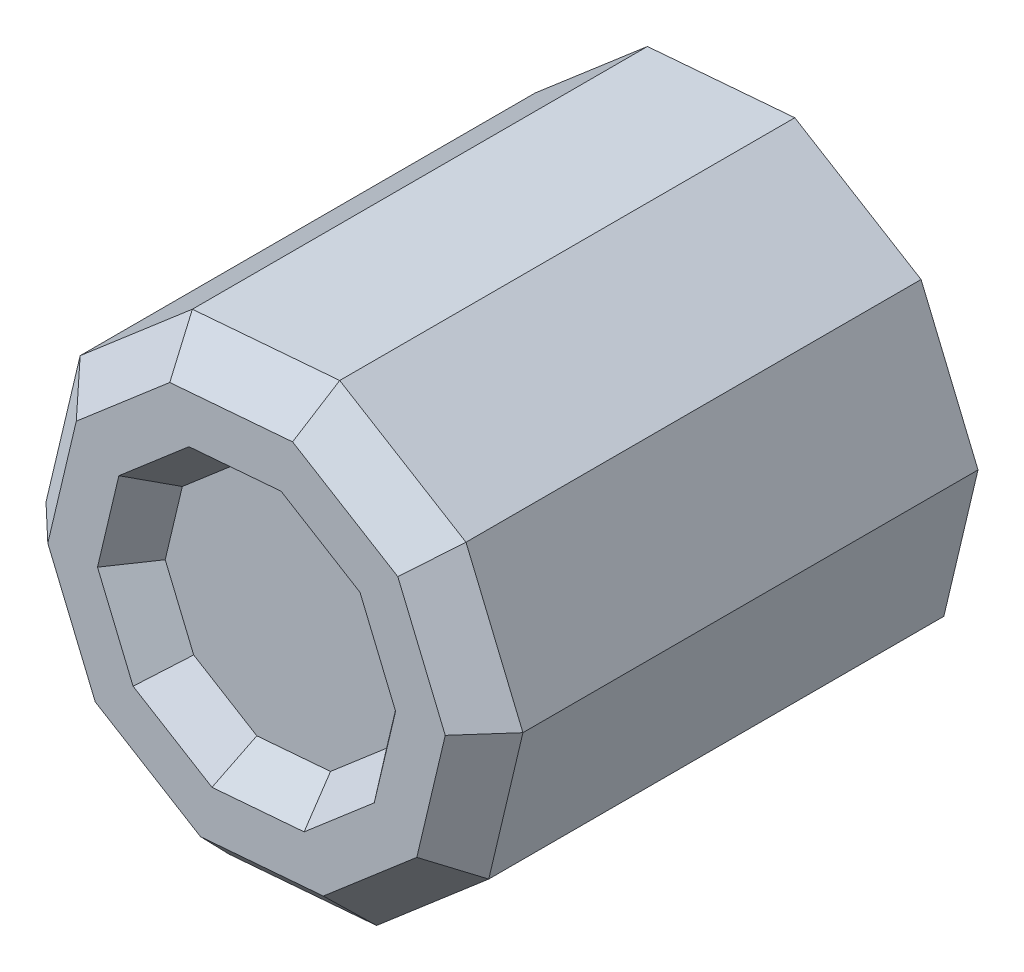
ISO-10303-21;
HEADER;
FILE_DESCRIPTION(('STEP AP214'),'2;1');
FILE_NAME('part.step','',(''),(''),'','','');
FILE_SCHEMA(('AUTOMOTIVE_DESIGN { 1 0 10303 214 1 1 1 1 }'));
ENDSEC;
DATA;
#1=APPLICATION_CONTEXT('core data for automotive mechanical design processes');
#2=APPLICATION_PROTOCOL_DEFINITION('international standard','automotive_design',2000,#1);
#3=PRODUCT_CONTEXT('',#1,'mechanical');
#4=PRODUCT('Part','Part','',(#3));
#5=PRODUCT_RELATED_PRODUCT_CATEGORY('part','',(#4));
#6=PRODUCT_DEFINITION_FORMATION('','',#4);
#7=PRODUCT_DEFINITION_CONTEXT('part definition',#1,'design');
#8=PRODUCT_DEFINITION('design','',#6,#7);
#9=PRODUCT_DEFINITION_SHAPE('','',#8);
#10=(LENGTH_UNIT() NAMED_UNIT(*) SI_UNIT(.MILLI.,.METRE.));
#11=(NAMED_UNIT(*) PLANE_ANGLE_UNIT() SI_UNIT($,.RADIAN.));
#12=(NAMED_UNIT(*) SI_UNIT($,.STERADIAN.) SOLID_ANGLE_UNIT());
#13=UNCERTAINTY_MEASURE_WITH_UNIT(LENGTH_MEASURE(1.E-05),#10,'distance_accuracy_value','');
#14=(GEOMETRIC_REPRESENTATION_CONTEXT(3) GLOBAL_UNCERTAINTY_ASSIGNED_CONTEXT((#13)) GLOBAL_UNIT_ASSIGNED_CONTEXT((#10,
#11,#12)) REPRESENTATION_CONTEXT('',''));
#15=CARTESIAN_POINT('',(0.,0.,0.));
#16=DIRECTION('',(0.,0.,1.));
#17=DIRECTION('',(1.,0.,0.));
#18=AXIS2_PLACEMENT_3D('',#15,#16,#17);
#19=CARTESIAN_POINT('',(0.,0.,12.));
#20=DIRECTION('',(0.,0.,1.));
#21=DIRECTION('',(1.,0.,0.));
#22=AXIS2_PLACEMENT_3D('',#19,#20,#21);
#23=PLANE('',#22);
#24=DIRECTION('',(-0.996714502075238,-0.0809950699296505,0.));
#25=VECTOR('',#24,1.);
#26=CARTESIAN_POINT('',(0.910714137433383,3.83636773347429,12.));
#27=LINE('',#26,#25);
#28=CARTESIAN_POINT('',(0.910714137433383,3.83636773347429,12.));
#29=VERTEX_POINT('',#28);
#30=CARTESIAN_POINT('',(-1.51817716190576,3.63899103209,12.));
#31=VERTEX_POINT('',#30);
#32=EDGE_CURVE('E569',#29,#31,#27,.T.);
#33=ORIENTED_EDGE('',*,*,#32,.F.);
#34=DIRECTION('',(-0.853966678331878,0.520327697032187,0.));
#35=VECTOR('',#34,1.);
#36=CARTESIAN_POINT('',(2.99174359030801,2.56838235401479,12.));
#37=LINE('',#36,#35);
#38=CARTESIAN_POINT('',(2.99174359030801,2.56838235401479,12.));
#39=VERTEX_POINT('',#38);
#40=EDGE_CURVE('E300',#39,#29,#37,.T.);
#41=ORIENTED_EDGE('',*,*,#40,.F.);
#42=DIRECTION('',(-0.385032608725588,0.922902969015686,0.));
#43=VECTOR('',#42,1.);
#44=CARTESIAN_POINT('',(3.93002867730962,0.319362211427114,12.));
#45=LINE('',#44,#43);
#46=CARTESIAN_POINT('',(3.93002867730962,0.319362211427114,12.));
#47=VERTEX_POINT('',#46);
#48=EDGE_CURVE('E304',#47,#39,#45,.T.);
#49=ORIENTED_EDGE('',*,*,#48,.F.);
#50=DIRECTION('',(0.230970830636836,0.972960675153385,0.));
#51=VECTOR('',#50,1.);
#52=CARTESIAN_POINT('',(3.36717638634075,-2.05164344120339,12.));
#53=LINE('',#52,#51);
#54=CARTESIAN_POINT('',(3.36717638634075,-2.05164344120339,12.));
#55=VERTEX_POINT('',#54);
#56=EDGE_CURVE('E564',#55,#47,#53,.T.);
#57=ORIENTED_EDGE('',*,*,#56,.F.);
#58=DIRECTION('',(0.758751263105786,0.651380473099535,0.));
#59=VECTOR('',#58,1.);
#60=CARTESIAN_POINT('',(1.51817716190576,-3.63899103209,12.));
#61=LINE('',#60,#59);
#62=CARTESIAN_POINT('',(1.51817716190576,-3.63899103209,12.));
#63=VERTEX_POINT('',#62);
#64=EDGE_CURVE('E577',#63,#55,#61,.T.);
#65=ORIENTED_EDGE('',*,*,#64,.F.);
#66=DIRECTION('',(0.996714502075238,0.0809950699296506,0.));
#67=VECTOR('',#66,1.);
#68=CARTESIAN_POINT('',(-0.910714137433379,-3.83636773347429,12.));
#69=LINE('',#68,#67);
#70=CARTESIAN_POINT('',(-0.910714137433379,-3.83636773347429,12.));
#71=VERTEX_POINT('',#70);
#72=EDGE_CURVE('E400',#71,#63,#69,.T.);
#73=ORIENTED_EDGE('',*,*,#72,.F.);
#74=DIRECTION('',(0.853966678331878,-0.520327697032187,0.));
#75=VECTOR('',#74,1.);
#76=CARTESIAN_POINT('',(-2.99174359030801,-2.56838235401479,12.));
#77=LINE('',#76,#75);
#78=CARTESIAN_POINT('',(-2.99174359030801,-2.56838235401479,12.));
#79=VERTEX_POINT('',#78);
#80=EDGE_CURVE('E420',#79,#71,#77,.T.);
#81=ORIENTED_EDGE('',*,*,#80,.F.);
#82=DIRECTION('',(0.385032608725588,-0.922902969015686,0.));
#83=VECTOR('',#82,1.);
#84=CARTESIAN_POINT('',(-3.93002867730962,-0.319362211427115,12.));
#85=LINE('',#84,#83);
#86=CARTESIAN_POINT('',(-3.93002867730962,-0.319362211427115,12.));
#87=VERTEX_POINT('',#86);
#88=EDGE_CURVE('E584',#87,#79,#85,.T.);
#89=ORIENTED_EDGE('',*,*,#88,.F.);
#90=DIRECTION('',(-0.230970830636837,-0.972960675153384,0.));
#91=VECTOR('',#90,1.);
#92=CARTESIAN_POINT('',(-3.36717638634075,2.05164344120339,12.));
#93=LINE('',#92,#91);
#94=CARTESIAN_POINT('',(-3.36717638634075,2.05164344120339,12.));
#95=VERTEX_POINT('',#94);
#96=EDGE_CURVE('E593',#95,#87,#93,.T.);
#97=ORIENTED_EDGE('',*,*,#96,.F.);
#98=DIRECTION('',(-0.758751263105786,-0.651380473099535,0.));
#99=VECTOR('',#98,1.);
#100=CARTESIAN_POINT('',(-1.51817716190576,3.63899103209,12.));
#101=LINE('',#100,#99);
#102=EDGE_CURVE('E84',#31,#95,#101,.T.);
#103=ORIENTED_EDGE('',*,*,#102,.F.);
#104=EDGE_LOOP('',(#33,#41,#49,#57,#65,#73,#81,#89,#97,#103));
#105=FACE_BOUND('',#104,.T.);
#106=DIRECTION('',(0.230970830636847,0.972960675153382,0.));
#107=VECTOR('',#106,1.);
#108=CARTESIAN_POINT('',(5.31508520854203,0.741950368920169,12.));
#109=LINE('',#108,#107);
#110=CARTESIAN_POINT('',(4.48956851512098,-2.73552458827124,12.));
#111=VERTEX_POINT('',#110);
#112=CARTESIAN_POINT('',(5.24003823641284,0.425816281902766,12.));
#113=VERTEX_POINT('',#112);
#114=EDGE_CURVE('E827',#111,#113,#109,.T.);
#115=ORIENTED_EDGE('',*,*,#114,.T.);
#116=DIRECTION('',(-0.385032608725579,0.92290296901569,0.));
#117=VECTOR('',#116,1.);
#118=CARTESIAN_POINT('',(3.86388677547718,3.72437915769805,12.));
#119=LINE('',#118,#117);
#120=CARTESIAN_POINT('',(3.98899145374405,3.42450980535302,12.));
#121=VERTEX_POINT('',#120);
#122=EDGE_CURVE('E830',#113,#121,#119,.T.);
#123=ORIENTED_EDGE('',*,*,#122,.T.);
#124=DIRECTION('',(-0.853966678331873,0.520327697032195,0.));
#125=VECTOR('',#124,1.);
#126=CARTESIAN_POINT('',(0.936814922861278,5.28422169522697,12.));
#127=LINE('',#126,#125);
#128=CARTESIAN_POINT('',(1.21428551657789,5.11515697796571,12.));
#129=VERTEX_POINT('',#128);
#130=EDGE_CURVE('E803',#121,#129,#127,.T.);
#131=ORIENTED_EDGE('',*,*,#130,.T.);
#132=DIRECTION('',(-0.99671450207524,-0.0809950699296405,0.));
#133=VECTOR('',#132,1.);
#134=CARTESIAN_POINT('',(-2.34808838911952,4.82567114926879,12.));
#135=LINE('',#134,#133);
#136=CARTESIAN_POINT('',(-2.0242362158743,4.85198804278669,12.));
#137=VERTEX_POINT('',#136);
#138=EDGE_CURVE('E806',#129,#137,#135,.T.);
#139=ORIENTED_EDGE('',*,*,#138,.T.);
#140=DIRECTION('',(-0.758751263105793,-0.651380473099528,0.));
#141=VECTOR('',#140,1.);
#142=CARTESIAN_POINT('',(-4.73610174504565,2.52387824281969,12.));
#143=LINE('',#142,#141);
#144=CARTESIAN_POINT('',(-4.48956851512098,2.73552458827124,12.));
#145=VERTEX_POINT('',#144);
#146=EDGE_CURVE('E809',#137,#145,#143,.T.);
#147=ORIENTED_EDGE('',*,*,#146,.T.);
#148=DIRECTION('',(-0.230970830636847,-0.972960675153382,0.));
#149=VECTOR('',#148,1.);
#150=CARTESIAN_POINT('',(-5.31508520854203,-0.741950368920166,12.));
#151=LINE('',#150,#149);
#152=CARTESIAN_POINT('',(-5.24003823641284,-0.425816281902766,12.));
#153=VERTEX_POINT('',#152);
#154=EDGE_CURVE('E812',#145,#153,#151,.T.);
#155=ORIENTED_EDGE('',*,*,#154,.T.);
#156=DIRECTION('',(0.385032608725579,-0.92290296901569,0.));
#157=VECTOR('',#156,1.);
#158=CARTESIAN_POINT('',(-3.86388677547717,-3.72437915769805,12.));
#159=LINE('',#158,#157);
#160=CARTESIAN_POINT('',(-3.98899145374405,-3.42450980535302,12.));
#161=VERTEX_POINT('',#160);
#162=EDGE_CURVE('E815',#153,#161,#159,.T.);
#163=ORIENTED_EDGE('',*,*,#162,.T.);
#164=DIRECTION('',(0.853966678331873,-0.520327697032195,0.));
#165=VECTOR('',#164,1.);
#166=CARTESIAN_POINT('',(-0.936814922861274,-5.28422169522697,12.));
#167=LINE('',#166,#165);
#168=CARTESIAN_POINT('',(-1.21428551657789,-5.11515697796571,12.));
#169=VERTEX_POINT('',#168);
#170=EDGE_CURVE('E818',#161,#169,#167,.T.);
#171=ORIENTED_EDGE('',*,*,#170,.T.);
#172=DIRECTION('',(0.99671450207524,0.0809950699296404,0.));
#173=VECTOR('',#172,1.);
#174=CARTESIAN_POINT('',(2.34808838911952,-4.82567114926879,12.));
#175=LINE('',#174,#173);
#176=CARTESIAN_POINT('',(2.0242362158743,-4.85198804278669,12.));
#177=VERTEX_POINT('',#176);
#178=EDGE_CURVE('E821',#169,#177,#175,.T.);
#179=ORIENTED_EDGE('',*,*,#178,.T.);
#180=DIRECTION('',(0.758751263105793,0.651380473099527,0.));
#181=VECTOR('',#180,1.);
#182=CARTESIAN_POINT('',(4.73610174504565,-2.52387824281969,12.));
#183=LINE('',#182,#181);
#184=EDGE_CURVE('E824',#177,#111,#183,.T.);
#185=ORIENTED_EDGE('',*,*,#184,.T.);
#186=EDGE_LOOP('',(#115,#123,#131,#139,#147,#155,#163,#171,#179,#185));
#187=FACE_BOUND('',#186,.T.);
#188=ADVANCED_FACE('F67',(#105,#187),#23,.T.);
#189=CARTESIAN_POINT('',(4.78678974449287,4.10941176642363,12.));
#190=DIRECTION('',(-0.520327697032195,-0.853966678331873,0.));
#191=DIRECTION('',(0.853966678331873,-0.520327697032195,0.));
#192=AXIS2_PLACEMENT_3D('',#189,#190,#191);
#193=PLANE('',#192);
#194=DIRECTION('',(0.,0.,-1.));
#195=VECTOR('',#194,1.);
#196=CARTESIAN_POINT('',(1.45714261989347,6.13818837355885,12.));
#197=LINE('',#196,#195);
#198=CARTESIAN_POINT('',(1.45714261989347,6.13818837355885,11.));
#199=VERTEX_POINT('',#198);
#200=CARTESIAN_POINT('',(1.45714261989354,6.13818837355883,-1.));
#201=VERTEX_POINT('',#200);
#202=EDGE_CURVE('E248',#199,#201,#197,.T.);
#203=ORIENTED_EDGE('',*,*,#202,.F.);
#204=DIRECTION('',(0.853966678331873,-0.520327697032195,0.));
#205=VECTOR('',#204,1.);
#206=CARTESIAN_POINT('',(4.78678974449287,4.10941176642363,11.));
#207=LINE('',#206,#205);
#208=CARTESIAN_POINT('',(4.78678974449287,4.10941176642363,11.));
#209=VERTEX_POINT('',#208);
#210=EDGE_CURVE('E77',#199,#209,#207,.T.);
#211=ORIENTED_EDGE('',*,*,#210,.T.);
#212=DIRECTION('',(0.,0.,-1.));
#213=VECTOR('',#212,1.);
#214=CARTESIAN_POINT('',(4.78678974449287,4.10941176642363,12.));
#215=LINE('',#214,#213);
#216=CARTESIAN_POINT('',(4.78678974449291,4.10941176642357,-1.));
#217=VERTEX_POINT('',#216);
#218=EDGE_CURVE('E772',#209,#217,#215,.T.);
#219=ORIENTED_EDGE('',*,*,#218,.T.);
#220=DIRECTION('',(0.853966678331867,-0.520327697032204,0.));
#221=VECTOR('',#220,1.);
#222=CARTESIAN_POINT('',(1.45714261989354,6.13818837355883,-1.));
#223=LINE('',#222,#221);
#224=EDGE_CURVE('E258',#201,#217,#223,.T.);
#225=ORIENTED_EDGE('',*,*,#224,.F.);
#226=EDGE_LOOP('',(#203,#211,#219,#225));
#227=FACE_BOUND('',#226,.T.);
#228=ADVANCED_FACE('F610',(#227),#193,.F.);
#229=CARTESIAN_POINT('',(1.45714261989347,6.13818837355885,12.));
#230=DIRECTION('',(0.0809950699296404,-0.996714502075239,0.));
#231=DIRECTION('',(0.99671450207524,0.0809950699296405,0.));
#232=AXIS2_PLACEMENT_3D('',#229,#230,#231);
#233=PLANE('',#232);
#234=DIRECTION('',(0.,0.,-1.));
#235=VECTOR('',#234,1.);
#236=CARTESIAN_POINT('',(-2.42908345904916,5.82238565134403,12.));
#237=LINE('',#236,#235);
#238=CARTESIAN_POINT('',(-2.42908345904916,5.82238565134403,11.));
#239=VERTEX_POINT('',#238);
#240=CARTESIAN_POINT('',(-2.4290834590491,5.82238565134405,-1.));
#241=VERTEX_POINT('',#240);
#242=EDGE_CURVE('E238',#239,#241,#237,.T.);
#243=ORIENTED_EDGE('',*,*,#242,.F.);
#244=DIRECTION('',(0.99671450207524,0.0809950699296405,0.));
#245=VECTOR('',#244,1.);
#246=CARTESIAN_POINT('',(1.45714261989347,6.13818837355885,11.));
#247=LINE('',#246,#245);
#248=EDGE_CURVE('E93',#239,#199,#247,.T.);
#249=ORIENTED_EDGE('',*,*,#248,.T.);
#250=ORIENTED_EDGE('',*,*,#202,.T.);
#251=DIRECTION('',(0.99671450207524,0.08099506992963,0.));
#252=VECTOR('',#251,1.);
#253=CARTESIAN_POINT('',(-2.4290834590491,5.82238565134405,-1.));
#254=LINE('',#253,#252);
#255=EDGE_CURVE('E252',#241,#201,#254,.T.);
#256=ORIENTED_EDGE('',*,*,#255,.F.);
#257=EDGE_LOOP('',(#243,#249,#250,#256));
#258=FACE_BOUND('',#257,.T.);
#259=ADVANCED_FACE('F253',(#258),#233,.F.);
#260=CARTESIAN_POINT('',(-2.42908345904916,5.82238565134403,12.));
#261=DIRECTION('',(0.651380473099528,-0.758751263105793,0.));
#262=DIRECTION('',(0.758751263105793,0.651380473099528,0.));
#263=AXIS2_PLACEMENT_3D('',#260,#261,#262);
#264=PLANE('',#263);
#265=DIRECTION('',(0.,0.,-1.));
#266=VECTOR('',#265,1.);
#267=CARTESIAN_POINT('',(-5.38748221814517,3.28262950592548,12.));
#268=LINE('',#267,#266);
#269=CARTESIAN_POINT('',(-5.38748221814517,3.28262950592548,11.));
#270=VERTEX_POINT('',#269);
#271=CARTESIAN_POINT('',(-5.38748221814514,3.28262950592554,-1.));
#272=VERTEX_POINT('',#271);
#273=EDGE_CURVE('E249',#270,#272,#268,.T.);
#274=ORIENTED_EDGE('',*,*,#273,.F.);
#275=DIRECTION('',(0.758751263105793,0.651380473099528,0.));
#276=VECTOR('',#275,1.);
#277=CARTESIAN_POINT('',(-2.42908345904916,5.82238565134403,11.));
#278=LINE('',#277,#276);
#279=EDGE_CURVE('E245',#270,#239,#278,.T.);
#280=ORIENTED_EDGE('',*,*,#279,.T.);
#281=ORIENTED_EDGE('',*,*,#242,.T.);
#282=DIRECTION('',(0.758751263105799,0.65138047309952,0.));
#283=VECTOR('',#282,1.);
#284=CARTESIAN_POINT('',(-5.38748221814514,3.28262950592554,-1.));
#285=LINE('',#284,#283);
#286=EDGE_CURVE('E243',#272,#241,#285,.T.);
#287=ORIENTED_EDGE('',*,*,#286,.F.);
#288=EDGE_LOOP('',(#274,#280,#281,#287));
#289=FACE_BOUND('',#288,.T.);
#290=ADVANCED_FACE('F241',(#289),#264,.F.);
#291=CARTESIAN_POINT('',(-5.38748221814517,3.28262950592548,12.));
#292=DIRECTION('',(0.972960675153382,-0.230970830636847,0.));
#293=DIRECTION('',(0.230970830636847,0.972960675153382,0.));
#294=AXIS2_PLACEMENT_3D('',#291,#292,#293);
#295=PLANE('',#294);
#296=DIRECTION('',(0.,0.,-1.));
#297=VECTOR('',#296,1.);
#298=CARTESIAN_POINT('',(-6.28804588369541,-0.510979538283319,12.));
#299=LINE('',#298,#297);
#300=CARTESIAN_POINT('',(-6.28804588369541,-0.510979538283319,11.));
#301=VERTEX_POINT('',#300);
#302=CARTESIAN_POINT('',(-6.28804588369541,-0.510979538283256,-1.));
#303=VERTEX_POINT('',#302);
#304=EDGE_CURVE('E796',#301,#303,#299,.T.);
#305=ORIENTED_EDGE('',*,*,#304,.F.);
#306=DIRECTION('',(0.230970830636847,0.972960675153382,0.));
#307=VECTOR('',#306,1.);
#308=CARTESIAN_POINT('',(-5.38748221814517,3.28262950592548,11.));
#309=LINE('',#308,#307);
#310=EDGE_CURVE('E853',#301,#270,#309,.T.);
#311=ORIENTED_EDGE('',*,*,#310,.T.);
#312=ORIENTED_EDGE('',*,*,#273,.T.);
#313=DIRECTION('',(0.230970830636857,0.97296067515338,0.));
#314=VECTOR('',#313,1.);
#315=CARTESIAN_POINT('',(-6.28804588369541,-0.510979538283256,-1.));
#316=LINE('',#315,#314);
#317=EDGE_CURVE('E265',#303,#272,#316,.T.);
#318=ORIENTED_EDGE('',*,*,#317,.F.);
#319=EDGE_LOOP('',(#305,#311,#312,#318));
#320=FACE_BOUND('',#319,.T.);
#321=ADVANCED_FACE('F914',(#320),#295,.F.);
#322=CARTESIAN_POINT('',(-6.28804588369541,-0.510979538283319,12.));
#323=DIRECTION('',(0.92290296901569,0.385032608725579,0.));
#324=DIRECTION('',(-0.385032608725579,0.92290296901569,0.));
#325=AXIS2_PLACEMENT_3D('',#322,#323,#324);
#326=PLANE('',#325);
#327=DIRECTION('',(0.,0.,-1.));
#328=VECTOR('',#327,1.);
#329=CARTESIAN_POINT('',(-4.78678974449287,-4.10941176642362,12.));
#330=LINE('',#329,#328);
#331=CARTESIAN_POINT('',(-4.78678974449287,-4.10941176642362,11.));
#332=VERTEX_POINT('',#331);
#333=CARTESIAN_POINT('',(-4.78678974449291,-4.10941176642357,-1.));
#334=VERTEX_POINT('',#333);
#335=EDGE_CURVE('E793',#332,#334,#330,.T.);
#336=ORIENTED_EDGE('',*,*,#335,.F.);
#337=DIRECTION('',(-0.385032608725579,0.92290296901569,0.));
#338=VECTOR('',#337,1.);
#339=CARTESIAN_POINT('',(-6.28804588369541,-0.510979538283319,11.));
#340=LINE('',#339,#338);
#341=EDGE_CURVE('E850',#332,#301,#340,.T.);
#342=ORIENTED_EDGE('',*,*,#341,.T.);
#343=ORIENTED_EDGE('',*,*,#304,.T.);
#344=DIRECTION('',(-0.385032608725569,0.922902969015694,0.));
#345=VECTOR('',#344,1.);
#346=CARTESIAN_POINT('',(-4.78678974449291,-4.10941176642357,-1.));
#347=LINE('',#346,#345);
#348=EDGE_CURVE('E295',#334,#303,#347,.T.);
#349=ORIENTED_EDGE('',*,*,#348,.F.);
#350=EDGE_LOOP('',(#336,#342,#343,#349));
#351=FACE_BOUND('',#350,.T.);
#352=ADVANCED_FACE('F911',(#351),#326,.F.);
#353=CARTESIAN_POINT('',(-4.78678974449287,-4.10941176642362,12.));
#354=DIRECTION('',(0.520327697032195,0.853966678331873,0.));
#355=DIRECTION('',(-0.853966678331873,0.520327697032195,0.));
#356=AXIS2_PLACEMENT_3D('',#353,#354,#355);
#357=PLANE('',#356);
#358=DIRECTION('',(0.,0.,-1.));
#359=VECTOR('',#358,1.);
#360=CARTESIAN_POINT('',(-1.45714261989347,-6.13818837355885,12.));
#361=LINE('',#360,#359);
#362=CARTESIAN_POINT('',(-1.45714261989347,-6.13818837355885,11.));
#363=VERTEX_POINT('',#362);
#364=CARTESIAN_POINT('',(-1.45714261989354,-6.13818837355883,-1.));
#365=VERTEX_POINT('',#364);
#366=EDGE_CURVE('E790',#363,#365,#361,.T.);
#367=ORIENTED_EDGE('',*,*,#366,.F.);
#368=DIRECTION('',(-0.853966678331873,0.520327697032195,0.));
#369=VECTOR('',#368,1.);
#370=CARTESIAN_POINT('',(-4.78678974449287,-4.10941176642362,11.));
#371=LINE('',#370,#369);
#372=EDGE_CURVE('E847',#363,#332,#371,.T.);
#373=ORIENTED_EDGE('',*,*,#372,.T.);
#374=ORIENTED_EDGE('',*,*,#335,.T.);
#375=DIRECTION('',(-0.853966678331867,0.520327697032204,0.));
#376=VECTOR('',#375,1.);
#377=CARTESIAN_POINT('',(-1.45714261989354,-6.13818837355883,-1.));
#378=LINE('',#377,#376);
#379=EDGE_CURVE('E291',#365,#334,#378,.T.);
#380=ORIENTED_EDGE('',*,*,#379,.F.);
#381=EDGE_LOOP('',(#367,#373,#374,#380));
#382=FACE_BOUND('',#381,.T.);
#383=ADVANCED_FACE('F969',(#382),#357,.F.);
#384=CARTESIAN_POINT('',(-1.45714261989347,-6.13818837355885,12.));
#385=DIRECTION('',(-0.0809950699296404,0.996714502075239,0.));
#386=DIRECTION('',(-0.99671450207524,-0.0809950699296404,0.));
#387=AXIS2_PLACEMENT_3D('',#384,#385,#386);
#388=PLANE('',#387);
#389=DIRECTION('',(0.,0.,-1.));
#390=VECTOR('',#389,1.);
#391=CARTESIAN_POINT('',(2.42908345904916,-5.82238565134403,12.));
#392=LINE('',#391,#390);
#393=CARTESIAN_POINT('',(2.42908345904916,-5.82238565134403,11.));
#394=VERTEX_POINT('',#393);
#395=CARTESIAN_POINT('',(2.42908345904909,-5.82238565134405,-1.));
#396=VERTEX_POINT('',#395);
#397=EDGE_CURVE('E787',#394,#396,#392,.T.);
#398=ORIENTED_EDGE('',*,*,#397,.F.);
#399=DIRECTION('',(-0.99671450207524,-0.0809950699296404,0.));
#400=VECTOR('',#399,1.);
#401=CARTESIAN_POINT('',(-1.45714261989347,-6.13818837355885,11.));
#402=LINE('',#401,#400);
#403=EDGE_CURVE('E844',#394,#363,#402,.T.);
#404=ORIENTED_EDGE('',*,*,#403,.T.);
#405=ORIENTED_EDGE('',*,*,#366,.T.);
#406=DIRECTION('',(-0.99671450207524,-0.0809950699296296,0.));
#407=VECTOR('',#406,1.);
#408=CARTESIAN_POINT('',(2.42908345904909,-5.82238565134405,-1.));
#409=LINE('',#408,#407);
#410=EDGE_CURVE('E287',#396,#365,#409,.T.);
#411=ORIENTED_EDGE('',*,*,#410,.F.);
#412=EDGE_LOOP('',(#398,#404,#405,#411));
#413=FACE_BOUND('',#412,.T.);
#414=ADVANCED_FACE('F965',(#413),#388,.F.);
#415=CARTESIAN_POINT('',(2.42908345904916,-5.82238565134403,12.));
#416=DIRECTION('',(-0.651380473099527,0.758751263105793,0.));
#417=DIRECTION('',(-0.758751263105793,-0.651380473099527,0.));
#418=AXIS2_PLACEMENT_3D('',#415,#416,#417);
#419=PLANE('',#418);
#420=DIRECTION('',(0.,0.,-1.));
#421=VECTOR('',#420,1.);
#422=CARTESIAN_POINT('',(5.38748221814517,-3.28262950592548,12.));
#423=LINE('',#422,#421);
#424=CARTESIAN_POINT('',(5.38748221814517,-3.28262950592548,11.));
#425=VERTEX_POINT('',#424);
#426=CARTESIAN_POINT('',(5.38748221814514,-3.28262950592554,-1.));
#427=VERTEX_POINT('',#426);
#428=EDGE_CURVE('E784',#425,#427,#423,.T.);
#429=ORIENTED_EDGE('',*,*,#428,.F.);
#430=DIRECTION('',(-0.758751263105793,-0.651380473099527,0.));
#431=VECTOR('',#430,1.);
#432=CARTESIAN_POINT('',(2.42908345904916,-5.82238565134403,11.));
#433=LINE('',#432,#431);
#434=EDGE_CURVE('E841',#425,#394,#433,.T.);
#435=ORIENTED_EDGE('',*,*,#434,.T.);
#436=ORIENTED_EDGE('',*,*,#397,.T.);
#437=DIRECTION('',(-0.758751263105799,-0.65138047309952,0.));
#438=VECTOR('',#437,1.);
#439=CARTESIAN_POINT('',(5.38748221814514,-3.28262950592554,-1.));
#440=LINE('',#439,#438);
#441=EDGE_CURVE('E283',#427,#396,#440,.T.);
#442=ORIENTED_EDGE('',*,*,#441,.F.);
#443=EDGE_LOOP('',(#429,#435,#436,#442));
#444=FACE_BOUND('',#443,.T.);
#445=ADVANCED_FACE('F953',(#444),#419,.F.);
#446=CARTESIAN_POINT('',(5.38748221814517,-3.28262950592548,12.));
#447=DIRECTION('',(-0.972960675153382,0.230970830636847,0.));
#448=DIRECTION('',(-0.230970830636847,-0.972960675153382,0.));
#449=AXIS2_PLACEMENT_3D('',#446,#447,#448);
#450=PLANE('',#449);
#451=DIRECTION('',(0.,0.,-1.));
#452=VECTOR('',#451,1.);
#453=CARTESIAN_POINT('',(6.28804588369541,0.510979538283322,12.));
#454=LINE('',#453,#452);
#455=CARTESIAN_POINT('',(6.28804588369541,0.510979538283322,11.));
#456=VERTEX_POINT('',#455);
#457=CARTESIAN_POINT('',(6.28804588369541,0.510979538283254,-1.));
#458=VERTEX_POINT('',#457);
#459=EDGE_CURVE('E780',#456,#458,#454,.T.);
#460=ORIENTED_EDGE('',*,*,#459,.F.);
#461=DIRECTION('',(-0.230970830636847,-0.972960675153382,0.));
#462=VECTOR('',#461,1.);
#463=CARTESIAN_POINT('',(5.38748221814517,-3.28262950592548,11.));
#464=LINE('',#463,#462);
#465=EDGE_CURVE('E838',#456,#425,#464,.T.);
#466=ORIENTED_EDGE('',*,*,#465,.T.);
#467=ORIENTED_EDGE('',*,*,#428,.T.);
#468=DIRECTION('',(-0.230970830636857,-0.97296067515338,0.));
#469=VECTOR('',#468,1.);
#470=CARTESIAN_POINT('',(6.28804588369541,0.510979538283254,-1.));
#471=LINE('',#470,#469);
#472=EDGE_CURVE('E279',#458,#427,#471,.T.);
#473=ORIENTED_EDGE('',*,*,#472,.F.);
#474=EDGE_LOOP('',(#460,#466,#467,#473));
#475=FACE_BOUND('',#474,.T.);
#476=ADVANCED_FACE('F948',(#475),#450,.F.);
#477=CARTESIAN_POINT('',(6.28804588369541,0.510979538283322,12.));
#478=DIRECTION('',(-0.92290296901569,-0.385032608725579,0.));
#479=DIRECTION('',(0.385032608725579,-0.92290296901569,0.));
#480=AXIS2_PLACEMENT_3D('',#477,#478,#479);
#481=PLANE('',#480);
#482=ORIENTED_EDGE('',*,*,#218,.F.);
#483=DIRECTION('',(0.385032608725579,-0.92290296901569,0.));
#484=VECTOR('',#483,1.);
#485=CARTESIAN_POINT('',(6.28804588369541,0.510979538283322,11.));
#486=LINE('',#485,#484);
#487=EDGE_CURVE('E834',#209,#456,#486,.T.);
#488=ORIENTED_EDGE('',*,*,#487,.T.);
#489=ORIENTED_EDGE('',*,*,#459,.T.);
#490=DIRECTION('',(0.385032608725569,-0.922902969015694,0.));
#491=VECTOR('',#490,1.);
#492=CARTESIAN_POINT('',(4.78678974449291,4.10941176642357,-1.));
#493=LINE('',#492,#491);
#494=EDGE_CURVE('E275',#217,#458,#493,.T.);
#495=ORIENTED_EDGE('',*,*,#494,.F.);
#496=EDGE_LOOP('',(#482,#488,#489,#495));
#497=FACE_BOUND('',#496,.T.);
#498=ADVANCED_FACE('F613',(#497),#481,.F.);
#499=CARTESIAN_POINT('',(-4.61451484507845,-1.92516304362789,12.));
#500=DIRECTION('',(-0.652590947768193,-0.272259168607804,0.707106781186547));
#501=DIRECTION('',(-0.385032608725579,0.92290296901569,0.));
#502=AXIS2_PLACEMENT_3D('',#499,#500,#501);
#503=PLANE('',#502);
#504=DIRECTION('',(0.722236312286059,0.0586904078324719,0.689151757774652));
#505=VECTOR('',#504,1.);
#506=CARTESIAN_POINT('',(-4.9773042414062,-0.404465977222589,12.2506985475611));
#507=LINE('',#506,#505);
#508=EDGE_CURVE('E891',#301,#153,#507,.T.);
#509=ORIENTED_EDGE('',*,*,#508,.F.);
#510=ORIENTED_EDGE('',*,*,#341,.F.);
#511=DIRECTION('',(0.549804094419156,0.472001390375112,0.689151757774652));
#512=VECTOR('',#511,1.);
#513=CARTESIAN_POINT('',(-3.78898458100662,-3.25280587849089,12.2506985475611));
#514=LINE('',#513,#512);
#515=EDGE_CURVE('E781',#161,#332,#514,.F.);
#516=ORIENTED_EDGE('',*,*,#515,.F.);
#517=ORIENTED_EDGE('',*,*,#162,.F.);
#518=EDGE_LOOP('',(#509,#510,#516,#517));
#519=FACE_BOUND('',#518,.T.);
#520=ADVANCED_FACE('F70',(#519),#503,.T.);
#521=CARTESIAN_POINT('',(-2.60163848516097,-4.26983339165936,12.));
#522=DIRECTION('',(-0.367927243010645,-0.603845629155819,0.707106781186547));
#523=DIRECTION('',(-0.853966678331873,0.520327697032195,0.));
#524=AXIS2_PLACEMENT_3D('',#521,#522,#523);
#525=PLANE('',#524);
#526=ORIENTED_EDGE('',*,*,#515,.T.);
#527=ORIENTED_EDGE('',*,*,#372,.F.);
#528=DIRECTION('',(0.167365399637992,0.705023884531668,0.689151757774653));
#529=VECTOR('',#528,1.);
#530=CARTESIAN_POINT('',(-1.15340159351178,-4.85868449298112,12.2506985475611));
#531=LINE('',#530,#529);
#532=EDGE_CURVE('E887',#169,#363,#531,.F.);
#533=ORIENTED_EDGE('',*,*,#532,.F.);
#534=ORIENTED_EDGE('',*,*,#170,.F.);
#535=EDGE_LOOP('',(#526,#527,#533,#534));
#536=FACE_BOUND('',#535,.T.);
#537=ADVANCED_FACE('F901',(#536),#525,.T.);
#538=CARTESIAN_POINT('',(-4.86480337576691,1.15485415318423,12.));
#539=DIRECTION('',(-0.687987091228799,0.163321040599604,0.707106781186547));
#540=DIRECTION('',(0.230970830636847,0.972960675153382,0.));
#541=AXIS2_PLACEMENT_3D('',#538,#539,#540);
#542=PLANE('',#541);
#543=ORIENTED_EDGE('',*,*,#508,.T.);
#544=ORIENTED_EDGE('',*,*,#154,.F.);
#545=DIRECTION('',(0.618798806769071,-0.37703831568858,0.689151757774652));
#546=VECTOR('',#545,1.);
#547=CARTESIAN_POINT('',(-4.26446285393762,2.59836618005179,12.2506985475611));
#548=LINE('',#547,#546);
#549=EDGE_CURVE('E883',#270,#145,#548,.T.);
#550=ORIENTED_EDGE('',*,*,#549,.F.);
#551=ORIENTED_EDGE('',*,*,#310,.F.);
#552=EDGE_LOOP('',(#543,#544,#550,#551));
#553=FACE_BOUND('',#552,.T.);
#554=ADVANCED_FACE('F918',(#553),#542,.T.);
#555=CARTESIAN_POINT('',(0.404975349648202,-4.9835725103762,12.));
#556=DIRECTION('',(0.0572721631899274,-0.704783583324376,0.707106781186547));
#557=DIRECTION('',(-0.99671450207524,-0.0809950699296404,0.));
#558=AXIS2_PLACEMENT_3D('',#555,#556,#557);
#559=PLANE('',#558);
#560=ORIENTED_EDGE('',*,*,#532,.T.);
#561=ORIENTED_EDGE('',*,*,#403,.F.);
#562=DIRECTION('',(-0.279001189264176,0.668751217677607,0.689151757774653));
#563=VECTOR('',#562,1.);
#564=CARTESIAN_POINT('',(1.92274160002625,-4.60871077176462,12.2506985475611));
#565=LINE('',#564,#563);
#566=EDGE_CURVE('E879',#177,#394,#565,.F.);
#567=ORIENTED_EDGE('',*,*,#566,.F.);
#568=ORIENTED_EDGE('',*,*,#178,.F.);
#569=EDGE_LOOP('',(#560,#561,#567,#568));
#570=FACE_BOUND('',#569,.T.);
#571=ADVANCED_FACE('F962',(#570),#559,.T.);
#572=CARTESIAN_POINT('',(-3.25690236549764,3.79375631552896,12.));
#573=DIRECTION('',(-0.460595549661178,0.536518163375964,0.707106781186547));
#574=DIRECTION('',(0.758751263105793,0.651380473099528,0.));
#575=AXIS2_PLACEMENT_3D('',#572,#573,#574);
#576=PLANE('',#575);
#577=ORIENTED_EDGE('',*,*,#549,.T.);
#578=ORIENTED_EDGE('',*,*,#146,.F.);
#579=DIRECTION('',(0.279001189264177,-0.668751217677607,0.689151757774652));
#580=VECTOR('',#579,1.);
#581=CARTESIAN_POINT('',(-1.92274160002625,4.60871077176462,12.2506985475611));
#582=LINE('',#581,#580);
#583=EDGE_CURVE('E875',#239,#137,#582,.T.);
#584=ORIENTED_EDGE('',*,*,#583,.F.);
#585=ORIENTED_EDGE('',*,*,#279,.F.);
#586=EDGE_LOOP('',(#577,#578,#584,#585));
#587=FACE_BOUND('',#586,.T.);
#588=ADVANCED_FACE('F921',(#587),#576,.T.);
#589=CARTESIAN_POINT('',(3.25690236549764,-3.79375631552896,12.));
#590=DIRECTION('',(0.460595549661178,-0.536518163375965,0.707106781186547));
#591=DIRECTION('',(-0.758751263105793,-0.651380473099527,0.));
#592=AXIS2_PLACEMENT_3D('',#589,#590,#591);
#593=PLANE('',#592);
#594=ORIENTED_EDGE('',*,*,#566,.T.);
#595=ORIENTED_EDGE('',*,*,#434,.F.);
#596=DIRECTION('',(-0.618798806769071,0.37703831568858,0.689151757774652));
#597=VECTOR('',#596,1.);
#598=CARTESIAN_POINT('',(4.26446285393762,-2.5983661800518,12.2506985475611));
#599=LINE('',#598,#597);
#600=EDGE_CURVE('E871',#111,#425,#599,.F.);
#601=ORIENTED_EDGE('',*,*,#600,.F.);
#602=ORIENTED_EDGE('',*,*,#184,.F.);
#603=EDGE_LOOP('',(#594,#595,#601,#602));
#604=FACE_BOUND('',#603,.T.);
#605=ADVANCED_FACE('F956',(#604),#593,.T.);
#606=CARTESIAN_POINT('',(-0.404975349648202,4.9835725103762,12.));
#607=DIRECTION('',(-0.0572721631899274,0.704783583324376,0.707106781186547));
#608=DIRECTION('',(0.99671450207524,0.0809950699296405,0.));
#609=AXIS2_PLACEMENT_3D('',#606,#607,#608);
#610=PLANE('',#609);
#611=ORIENTED_EDGE('',*,*,#583,.T.);
#612=ORIENTED_EDGE('',*,*,#138,.F.);
#613=DIRECTION('',(-0.167365399637992,-0.705023884531668,0.689151757774652));
#614=VECTOR('',#613,1.);
#615=CARTESIAN_POINT('',(1.15340159351179,4.85868449298112,12.2506985475611));
#616=LINE('',#615,#614);
#617=EDGE_CURVE('E867',#199,#129,#616,.T.);
#618=ORIENTED_EDGE('',*,*,#617,.F.);
#619=ORIENTED_EDGE('',*,*,#248,.F.);
#620=EDGE_LOOP('',(#611,#612,#618,#619));
#621=FACE_BOUND('',#620,.T.);
#622=ADVANCED_FACE('F925',(#621),#610,.T.);
#623=CARTESIAN_POINT('',(4.86480337576691,-1.15485415318423,12.));
#624=DIRECTION('',(0.687987091228799,-0.163321040599604,0.707106781186547));
#625=DIRECTION('',(-0.230970830636847,-0.972960675153382,0.));
#626=AXIS2_PLACEMENT_3D('',#623,#624,#625);
#627=PLANE('',#626);
#628=ORIENTED_EDGE('',*,*,#600,.T.);
#629=ORIENTED_EDGE('',*,*,#465,.F.);
#630=DIRECTION('',(-0.722236312286059,-0.0586904078324734,0.689151757774652));
#631=VECTOR('',#630,1.);
#632=CARTESIAN_POINT('',(4.9773042414062,0.404465977222588,12.2506985475611));
#633=LINE('',#632,#631);
#634=EDGE_CURVE('E864',#113,#456,#633,.F.);
#635=ORIENTED_EDGE('',*,*,#634,.F.);
#636=ORIENTED_EDGE('',*,*,#114,.F.);
#637=EDGE_LOOP('',(#628,#629,#635,#636));
#638=FACE_BOUND('',#637,.T.);
#639=ADVANCED_FACE('F944',(#638),#627,.T.);
#640=CARTESIAN_POINT('',(2.60163848516097,4.26983339165936,12.));
#641=DIRECTION('',(0.367927243010645,0.603845629155819,0.707106781186547));
#642=DIRECTION('',(0.853966678331873,-0.520327697032195,0.));
#643=AXIS2_PLACEMENT_3D('',#640,#641,#642);
#644=PLANE('',#643);
#645=ORIENTED_EDGE('',*,*,#617,.T.);
#646=ORIENTED_EDGE('',*,*,#130,.F.);
#647=DIRECTION('',(0.549804094419157,0.472001390375111,-0.689151757774652));
#648=VECTOR('',#647,1.);
#649=CARTESIAN_POINT('',(3.78898458100661,3.25280587849089,12.2506985475611));
#650=LINE('',#649,#648);
#651=EDGE_CURVE('E688',#209,#121,#650,.F.);
#652=ORIENTED_EDGE('',*,*,#651,.F.);
#653=ORIENTED_EDGE('',*,*,#210,.F.);
#654=EDGE_LOOP('',(#645,#646,#652,#653));
#655=FACE_BOUND('',#654,.T.);
#656=ADVANCED_FACE('F930',(#655),#644,.T.);
#657=CARTESIAN_POINT('',(4.61451484507845,1.92516304362789,12.));
#658=DIRECTION('',(0.652590947768192,0.272259168607804,0.707106781186548));
#659=DIRECTION('',(0.385032608725579,-0.92290296901569,0.));
#660=AXIS2_PLACEMENT_3D('',#657,#658,#659);
#661=PLANE('',#660);
#662=ORIENTED_EDGE('',*,*,#634,.T.);
#663=ORIENTED_EDGE('',*,*,#487,.F.);
#664=ORIENTED_EDGE('',*,*,#651,.T.);
#665=ORIENTED_EDGE('',*,*,#122,.F.);
#666=EDGE_LOOP('',(#662,#663,#664,#665));
#667=FACE_BOUND('',#666,.T.);
#668=ADVANCED_FACE('F938',(#667),#661,.T.);
#669=CARTESIAN_POINT('',(0.,0.,11.));
#670=DIRECTION('',(0.,0.,1.));
#671=DIRECTION('',(1.,0.,0.));
#672=AXIS2_PLACEMENT_3D('',#669,#670,#671);
#673=PLANE('',#672);
#674=DIRECTION('',(-0.853966678331873,0.520327697032195,0.));
#675=VECTOR('',#674,1.);
#676=CARTESIAN_POINT('',(2.39339487224643,2.05470588321181,11.));
#677=LINE('',#676,#675);
#678=CARTESIAN_POINT('',(2.39339487224643,2.05470588321181,11.));
#679=VERTEX_POINT('',#678);
#680=CARTESIAN_POINT('',(0.728571309946739,3.06909418677942,11.));
#681=VERTEX_POINT('',#680);
#682=EDGE_CURVE('E499',#679,#681,#677,.T.);
#683=ORIENTED_EDGE('',*,*,#682,.T.);
#684=DIRECTION('',(-0.99671450207524,-0.0809950699296401,0.));
#685=VECTOR('',#684,1.);
#686=CARTESIAN_POINT('',(0.728571309946739,3.06909418677942,11.));
#687=LINE('',#686,#685);
#688=CARTESIAN_POINT('',(-1.21454172952458,2.91119282567201,11.));
#689=VERTEX_POINT('',#688);
#690=EDGE_CURVE('E533',#681,#689,#687,.T.);
#691=ORIENTED_EDGE('',*,*,#690,.T.);
#692=DIRECTION('',(-0.758751263105792,-0.651380473099528,0.));
#693=VECTOR('',#692,1.);
#694=CARTESIAN_POINT('',(-1.21454172952458,2.91119282567201,11.));
#695=LINE('',#694,#693);
#696=CARTESIAN_POINT('',(-2.69374110907259,1.64131475296274,11.));
#697=VERTEX_POINT('',#696);
#698=EDGE_CURVE('E747',#689,#697,#695,.T.);
#699=ORIENTED_EDGE('',*,*,#698,.T.);
#700=DIRECTION('',(-0.230970830636847,-0.972960675153382,0.));
#701=VECTOR('',#700,1.);
#702=CARTESIAN_POINT('',(-2.69374110907259,1.64131475296274,11.));
#703=LINE('',#702,#701);
#704=CARTESIAN_POINT('',(-3.14402294184771,-0.25548976914166,11.));
#705=VERTEX_POINT('',#704);
#706=EDGE_CURVE('E465',#697,#705,#703,.T.);
#707=ORIENTED_EDGE('',*,*,#706,.T.);
#708=DIRECTION('',(0.385032608725579,-0.92290296901569,0.));
#709=VECTOR('',#708,1.);
#710=CARTESIAN_POINT('',(-3.14402294184771,-0.25548976914166,11.));
#711=LINE('',#710,#709);
#712=CARTESIAN_POINT('',(-2.39339487224643,-2.05470588321181,11.));
#713=VERTEX_POINT('',#712);
#714=EDGE_CURVE('E452',#705,#713,#711,.T.);
#715=ORIENTED_EDGE('',*,*,#714,.T.);
#716=DIRECTION('',(0.853966678331873,-0.520327697032195,0.));
#717=VECTOR('',#716,1.);
#718=CARTESIAN_POINT('',(-2.39339487224643,-2.05470588321181,11.));
#719=LINE('',#718,#717);
#720=CARTESIAN_POINT('',(-0.728571309946737,-3.06909418677942,11.));
#721=VERTEX_POINT('',#720);
#722=EDGE_CURVE('E725',#713,#721,#719,.T.);
#723=ORIENTED_EDGE('',*,*,#722,.T.);
#724=DIRECTION('',(0.996714502075239,0.0809950699296405,0.));
#725=VECTOR('',#724,1.);
#726=CARTESIAN_POINT('',(-0.728571309946737,-3.06909418677942,11.));
#727=LINE('',#726,#725);
#728=CARTESIAN_POINT('',(1.21454172952458,-2.91119282567201,11.));
#729=VERTEX_POINT('',#728);
#730=EDGE_CURVE('E708',#721,#729,#727,.T.);
#731=ORIENTED_EDGE('',*,*,#730,.T.);
#732=DIRECTION('',(0.758751263105793,0.651380473099528,0.));
#733=VECTOR('',#732,1.);
#734=CARTESIAN_POINT('',(1.21454172952458,-2.91119282567201,11.));
#735=LINE('',#734,#733);
#736=CARTESIAN_POINT('',(2.69374110907259,-1.64131475296274,11.));
#737=VERTEX_POINT('',#736);
#738=EDGE_CURVE('E357',#729,#737,#735,.T.);
#739=ORIENTED_EDGE('',*,*,#738,.T.);
#740=DIRECTION('',(0.230970830636847,0.972960675153382,0.));
#741=VECTOR('',#740,1.);
#742=CARTESIAN_POINT('',(2.69374110907259,-1.64131475296274,11.));
#743=LINE('',#742,#741);
#744=CARTESIAN_POINT('',(3.14402294184771,0.255489769141661,11.));
#745=VERTEX_POINT('',#744);
#746=EDGE_CURVE('E344',#737,#745,#743,.T.);
#747=ORIENTED_EDGE('',*,*,#746,.T.);
#748=DIRECTION('',(-0.385032608725579,0.92290296901569,0.));
#749=VECTOR('',#748,1.);
#750=CARTESIAN_POINT('',(3.14402294184771,0.255489769141661,11.));
#751=LINE('',#750,#749);
#752=EDGE_CURVE('E683',#745,#679,#751,.T.);
#753=ORIENTED_EDGE('',*,*,#752,.T.);
#754=EDGE_LOOP('',(#683,#691,#699,#707,#715,#723,#731,#739,#747,#753));
#755=FACE_BOUND('',#754,.T.);
#756=ADVANCED_FACE('F480',(#755),#673,.T.);
#757=CARTESIAN_POINT('',(0.272143434963594,-3.34896072697284,2.52000000000006));
#758=DIRECTION('',(-0.0647960559437118,0.797371601660188,-0.600000000000005));
#759=DIRECTION('',(0.,0.601263538807887,0.799050784931857));
#760=AXIS2_PLACEMENT_3D('',#757,#758,#759);
#761=PLANE('',#760);
#762=DIRECTION('',(-0.143021749073016,-0.602476672729824,-0.785217573738958));
#763=VECTOR('',#762,1.);
#764=CARTESIAN_POINT('',(0.910714137433383,3.83636773347429,12.));
#765=LINE('',#764,#763);
#766=EDGE_CURVE('E563',#29,#681,#765,.T.);
#767=ORIENTED_EDGE('',*,*,#766,.F.);
#768=ORIENTED_EDGE('',*,*,#32,.T.);
#769=DIRECTION('',(0.238419877515529,-0.571479941815095,-0.785217573738958));
#770=VECTOR('',#769,1.);
#771=CARTESIAN_POINT('',(-1.51817716190576,3.63899103209,12.));
#772=LINE('',#771,#770);
#773=EDGE_CURVE('E506',#31,#689,#772,.T.);
#774=ORIENTED_EDGE('',*,*,#773,.T.);
#775=ORIENTED_EDGE('',*,*,#690,.F.);
#776=EDGE_LOOP('',(#767,#768,#774,#775));
#777=FACE_BOUND('',#776,.T.);
#778=ADVANCED_FACE('F517',(#777),#761,.F.);
#779=CARTESIAN_POINT('',(2.18863838961443,-2.54940424403549,2.52000000000005));
#780=DIRECTION('',(-0.52110437847962,0.607001010484632,-0.600000000000004));
#781=DIRECTION('',(0.,0.702993499193662,0.711196273957795));
#782=AXIS2_PLACEMENT_3D('',#779,#780,#781);
#783=PLANE('',#782);
#784=ORIENTED_EDGE('',*,*,#773,.F.);
#785=ORIENTED_EDGE('',*,*,#102,.T.);
#786=DIRECTION('',(0.52879321448673,-0.322197297015813,-0.785217573738958));
#787=VECTOR('',#786,1.);
#788=CARTESIAN_POINT('',(-3.36717638634075,2.05164344120339,12.));
#789=LINE('',#788,#787);
#790=EDGE_CURVE('E491',#95,#697,#789,.T.);
#791=ORIENTED_EDGE('',*,*,#790,.T.);
#792=ORIENTED_EDGE('',*,*,#698,.F.);
#793=EDGE_LOOP('',(#784,#785,#791,#792));
#794=FACE_BOUND('',#793,.T.);
#795=ADVANCED_FACE('F508',(#794),#783,.F.);
#796=CARTESIAN_POINT('',(-1.74830106202819,-2.86932803919512,2.52000000000005));
#797=DIRECTION('',(0.416262157625755,0.683173342665496,-0.600000000000004));
#798=DIRECTION('',(0.,0.659888409926958,0.75136361799336));
#799=AXIS2_PLACEMENT_3D('',#796,#797,#798);
#800=PLANE('',#799);
#801=DIRECTION('',(-0.469833928646128,-0.403347792090707,-0.785217573738958));
#802=VECTOR('',#801,1.);
#803=CARTESIAN_POINT('',(2.99174359030801,2.56838235401479,12.));
#804=LINE('',#803,#802);
#805=EDGE_CURVE('E1371',#39,#679,#804,.T.);
#806=ORIENTED_EDGE('',*,*,#805,.F.);
#807=ORIENTED_EDGE('',*,*,#40,.T.);
#808=ORIENTED_EDGE('',*,*,#766,.T.);
#809=ORIENTED_EDGE('',*,*,#682,.F.);
#810=EDGE_LOOP('',(#806,#807,#808,#809));
#811=FACE_BOUND('',#810,.T.);
#812=ADVANCED_FACE('F323',(#811),#800,.F.);
#813=CARTESIAN_POINT('',(-3.10095397589274,-1.29370956531795,2.52000000000004));
#814=DIRECTION('',(0.73832237521255,0.308026086980462,-0.600000000000003));
#815=DIRECTION('',(-0.630664211346668,0.,-0.77605583080503));
#816=AXIS2_PLACEMENT_3D('',#813,#814,#815);
#817=PLANE('',#816);
#818=DIRECTION('',(-0.617185516544312,-0.0501537641601652,-0.785217573738958));
#819=VECTOR('',#818,1.);
#820=CARTESIAN_POINT('',(3.93002867730962,0.319362211427114,12.));
#821=LINE('',#820,#819);
#822=EDGE_CURVE('E310',#47,#745,#821,.T.);
#823=ORIENTED_EDGE('',*,*,#822,.F.);
#824=ORIENTED_EDGE('',*,*,#48,.T.);
#825=ORIENTED_EDGE('',*,*,#805,.T.);
#826=ORIENTED_EDGE('',*,*,#752,.F.);
#827=EDGE_LOOP('',(#823,#824,#825,#826));
#828=FACE_BOUND('',#827,.T.);
#829=ADVANCED_FACE('F312',(#828),#817,.F.);
#830=CARTESIAN_POINT('',(-3.2691478685154,0.776061990939813,2.52000000000006));
#831=DIRECTION('',(0.778368540122702,-0.184776664509477,-0.600000000000005));
#832=DIRECTION('',(-0.610512700753967,0.,-0.792006466020383));
#833=AXIS2_PLACEMENT_3D('',#830,#831,#832);
#834=PLANE('',#833);
#835=DIRECTION('',(-0.52879321448673,0.322197297015813,-0.785217573738958));
#836=VECTOR('',#835,1.);
#837=CARTESIAN_POINT('',(3.36717638634075,-2.05164344120339,12.));
#838=LINE('',#837,#836);
#839=EDGE_CURVE('E393',#55,#737,#838,.T.);
#840=ORIENTED_EDGE('',*,*,#839,.F.);
#841=ORIENTED_EDGE('',*,*,#56,.T.);
#842=ORIENTED_EDGE('',*,*,#822,.T.);
#843=ORIENTED_EDGE('',*,*,#746,.F.);
#844=EDGE_LOOP('',(#840,#841,#842,#843));
#845=FACE_BOUND('',#844,.T.);
#846=ADVANCED_FACE('F322',(#845),#834,.F.);
#847=CARTESIAN_POINT('',(-2.18863838961443,2.54940424403549,2.52000000000005));
#848=DIRECTION('',(0.52110437847962,-0.607001010484631,-0.600000000000005));
#849=DIRECTION('',(0.,0.702993499193662,-0.711196273957795));
#850=AXIS2_PLACEMENT_3D('',#847,#848,#849);
#851=PLANE('',#850);
#852=DIRECTION('',(-0.23841987751553,0.571479941815095,-0.785217573738958));
#853=VECTOR('',#852,1.);
#854=CARTESIAN_POINT('',(1.51817716190576,-3.63899103209,12.));
#855=LINE('',#854,#853);
#856=EDGE_CURVE('E383',#63,#729,#855,.T.);
#857=ORIENTED_EDGE('',*,*,#856,.F.);
#858=ORIENTED_EDGE('',*,*,#64,.T.);
#859=ORIENTED_EDGE('',*,*,#839,.T.);
#860=ORIENTED_EDGE('',*,*,#738,.F.);
#861=EDGE_LOOP('',(#857,#858,#859,#860));
#862=FACE_BOUND('',#861,.T.);
#863=ADVANCED_FACE('F363',(#862),#851,.F.);
#864=CARTESIAN_POINT('',(-0.272143434963595,3.34896072697284,2.52000000000006));
#865=DIRECTION('',(0.0647960559437121,-0.797371601660188,-0.600000000000005));
#866=DIRECTION('',(0.,0.601263538807887,-0.799050784931857));
#867=AXIS2_PLACEMENT_3D('',#864,#865,#866);
#868=PLANE('',#867);
#869=DIRECTION('',(0.143021749073015,0.602476672729824,-0.785217573738958));
#870=VECTOR('',#869,1.);
#871=CARTESIAN_POINT('',(-0.910714137433379,-3.83636773347429,12.));
#872=LINE('',#871,#870);
#873=EDGE_CURVE('E392',#71,#721,#872,.T.);
#874=ORIENTED_EDGE('',*,*,#873,.F.);
#875=ORIENTED_EDGE('',*,*,#72,.T.);
#876=ORIENTED_EDGE('',*,*,#856,.T.);
#877=ORIENTED_EDGE('',*,*,#730,.F.);
#878=EDGE_LOOP('',(#874,#875,#876,#877));
#879=FACE_BOUND('',#878,.T.);
#880=ADVANCED_FACE('F372',(#879),#868,.F.);
#881=CARTESIAN_POINT('',(1.74830106202819,2.86932803919512,2.52000000000005));
#882=DIRECTION('',(-0.416262157625755,-0.683173342665496,-0.600000000000004));
#883=DIRECTION('',(0.,0.659888409926958,-0.75136361799336));
#884=AXIS2_PLACEMENT_3D('',#881,#882,#883);
#885=PLANE('',#884);
#886=DIRECTION('',(0.469833928646129,0.403347792090707,-0.785217573738958));
#887=VECTOR('',#886,1.);
#888=CARTESIAN_POINT('',(-2.99174359030801,-2.56838235401479,12.));
#889=LINE('',#888,#887);
#890=EDGE_CURVE('E413',#79,#713,#889,.T.);
#891=ORIENTED_EDGE('',*,*,#890,.F.);
#892=ORIENTED_EDGE('',*,*,#80,.T.);
#893=ORIENTED_EDGE('',*,*,#873,.T.);
#894=ORIENTED_EDGE('',*,*,#722,.F.);
#895=EDGE_LOOP('',(#891,#892,#893,#894));
#896=FACE_BOUND('',#895,.T.);
#897=ADVANCED_FACE('F425',(#896),#885,.F.);
#898=CARTESIAN_POINT('',(3.10095397589274,1.29370956531796,2.52000000000005));
#899=DIRECTION('',(-0.738322375212549,-0.308026086980462,-0.600000000000004));
#900=DIRECTION('',(-0.630664211346668,0.,0.77605583080503));
#901=AXIS2_PLACEMENT_3D('',#898,#899,#900);
#902=PLANE('',#901);
#903=DIRECTION('',(0.617185516544313,0.0501537641601664,-0.785217573738958));
#904=VECTOR('',#903,1.);
#905=CARTESIAN_POINT('',(-3.93002867730962,-0.319362211427115,12.));
#906=LINE('',#905,#904);
#907=EDGE_CURVE('E500',#87,#705,#906,.T.);
#908=ORIENTED_EDGE('',*,*,#907,.F.);
#909=ORIENTED_EDGE('',*,*,#88,.T.);
#910=ORIENTED_EDGE('',*,*,#890,.T.);
#911=ORIENTED_EDGE('',*,*,#714,.F.);
#912=EDGE_LOOP('',(#908,#909,#910,#911));
#913=FACE_BOUND('',#912,.T.);
#914=ADVANCED_FACE('F434',(#913),#902,.F.);
#915=CARTESIAN_POINT('',(3.26914786851539,-0.776061990939812,2.52000000000005));
#916=DIRECTION('',(-0.778368540122703,0.184776664509477,-0.600000000000004));
#917=DIRECTION('',(-0.610512700753967,0.,0.792006466020384));
#918=AXIS2_PLACEMENT_3D('',#915,#916,#917);
#919=PLANE('',#918);
#920=ORIENTED_EDGE('',*,*,#790,.F.);
#921=ORIENTED_EDGE('',*,*,#96,.T.);
#922=ORIENTED_EDGE('',*,*,#907,.T.);
#923=ORIENTED_EDGE('',*,*,#706,.F.);
#924=EDGE_LOOP('',(#920,#921,#922,#923));
#925=FACE_BOUND('',#924,.T.);
#926=ADVANCED_FACE('F471',(#925),#919,.F.);
#927=CARTESIAN_POINT('',(0.,0.,-1.));
#928=DIRECTION('',(0.,0.,-1.));
#929=DIRECTION('',(-1.,0.,0.));
#930=AXIS2_PLACEMENT_3D('',#927,#928,#929);
#931=PLANE('',#930);
#932=ORIENTED_EDGE('',*,*,#286,.T.);
#933=ORIENTED_EDGE('',*,*,#255,.T.);
#934=ORIENTED_EDGE('',*,*,#224,.T.);
#935=ORIENTED_EDGE('',*,*,#494,.T.);
#936=ORIENTED_EDGE('',*,*,#472,.T.);
#937=ORIENTED_EDGE('',*,*,#441,.T.);
#938=ORIENTED_EDGE('',*,*,#410,.T.);
#939=ORIENTED_EDGE('',*,*,#379,.T.);
#940=ORIENTED_EDGE('',*,*,#348,.T.);
#941=ORIENTED_EDGE('',*,*,#317,.T.);
#942=EDGE_LOOP('',(#932,#933,#934,#935,#936,#937,#938,#939,#940,#941));
#943=FACE_BOUND('',#942,.T.);
#944=CARTESIAN_POINT('',(0.,0.,-1.));
#945=DIRECTION('',(0.,0.,-1.));
#946=DIRECTION('',(-1.,0.,0.));
#947=AXIS2_PLACEMENT_3D('',#944,#945,#946);
#948=CIRCLE('',#947,3.);
#949=CARTESIAN_POINT('',(-3.,0.,-1.));
#950=VERTEX_POINT('',#949);
#951=EDGE_CURVE('E267',#950,#950,#948,.T.);
#952=ORIENTED_EDGE('',*,*,#951,.F.);
#953=EDGE_LOOP('',(#952));
#954=FACE_BOUND('',#953,.T.);
#955=ADVANCED_FACE('F261',(#943,#954),#931,.T.);
#956=CARTESIAN_POINT('',(0.,0.,10.));
#957=DIRECTION('',(0.,0.,1.));
#958=DIRECTION('',(1.,0.,0.));
#959=AXIS2_PLACEMENT_3D('',#956,#957,#958);
#960=PLANE('',#959);
#961=CARTESIAN_POINT('',(0.,0.,10.));
#962=DIRECTION('',(0.,0.,1.));
#963=DIRECTION('',(1.,0.,0.));
#964=AXIS2_PLACEMENT_3D('',#961,#962,#963);
#965=CIRCLE('',#964,3.);
#966=CARTESIAN_POINT('',(3.,0.,10.));
#967=VERTEX_POINT('',#966);
#968=EDGE_CURVE('E12',#967,#967,#965,.T.);
#969=ORIENTED_EDGE('',*,*,#968,.F.);
#970=EDGE_LOOP('',(#969));
#971=FACE_BOUND('',#970,.T.);
#972=ADVANCED_FACE('F612',(#971),#960,.F.);
#973=CARTESIAN_POINT('',(0.,0.,10.));
#974=DIRECTION('',(0.,0.,-1.));
#975=DIRECTION('',(-1.,0.,0.));
#976=AXIS2_PLACEMENT_3D('',#973,#974,#975);
#977=CYLINDRICAL_SURFACE('',#976,3.);
#978=ORIENTED_EDGE('',*,*,#968,.T.);
#979=EDGE_LOOP('',(#978));
#980=FACE_BOUND('',#979,.T.);
#981=ORIENTED_EDGE('',*,*,#951,.T.);
#982=EDGE_LOOP('',(#981));
#983=FACE_BOUND('',#982,.T.);
#984=ADVANCED_FACE('F1100',(#980,#983),#977,.F.);
#985=CLOSED_SHELL('',(#188,#228,#259,#290,#321,#352,#383,#414,#445,#476,#498,#520,#537,#554,
#571,#588,#605,#622,#639,#656,#668,#756,#778,#795,#812,#829,#846,#863,#880,#897,#914,#926,#955,
#972,#984));
#986=MANIFOLD_SOLID_BREP('B2',#985);
#987=ADVANCED_BREP_SHAPE_REPRESENTATION('',(#18,#986),#14);
#988=SHAPE_DEFINITION_REPRESENTATION(#9,#987);
ENDSEC;
END-ISO-10303-21;
